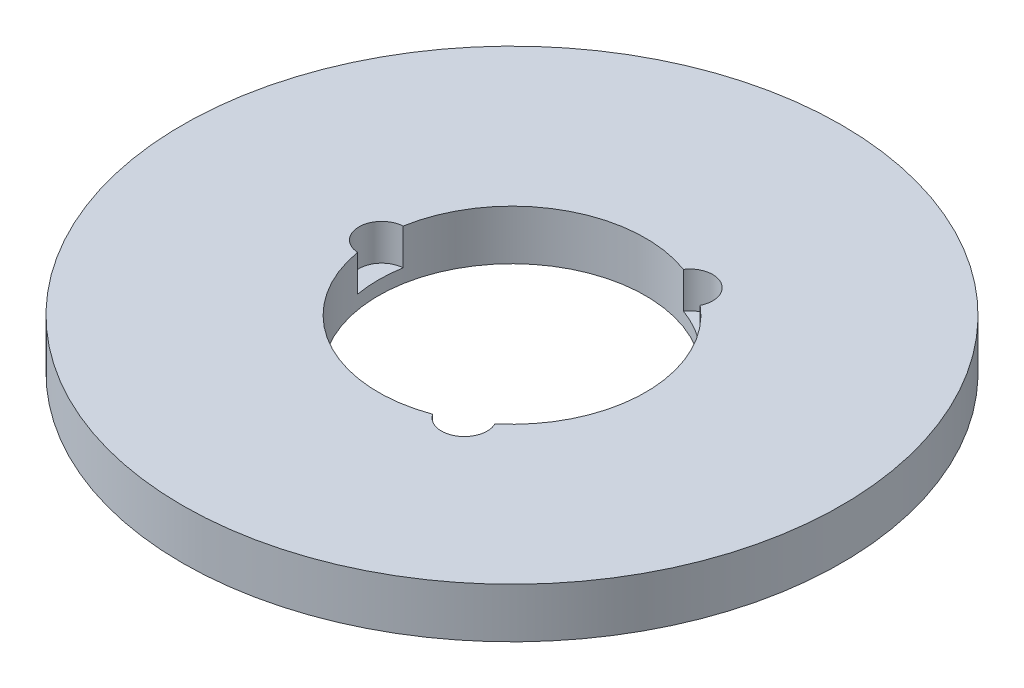
ISO-10303-21;
HEADER;
FILE_DESCRIPTION(('STEP AP214'),'2;1');
FILE_NAME('part.step','',(''),(''),'','','');
FILE_SCHEMA(('AUTOMOTIVE_DESIGN { 1 0 10303 214 1 1 1 1 }'));
ENDSEC;
DATA;
#1=APPLICATION_CONTEXT('core data for automotive mechanical design processes');
#2=APPLICATION_PROTOCOL_DEFINITION('international standard','automotive_design',2000,#1);
#3=PRODUCT_CONTEXT('',#1,'mechanical');
#4=PRODUCT('Part','Part','',(#3));
#5=PRODUCT_RELATED_PRODUCT_CATEGORY('part','',(#4));
#6=PRODUCT_DEFINITION_FORMATION('','',#4);
#7=PRODUCT_DEFINITION_CONTEXT('part definition',#1,'design');
#8=PRODUCT_DEFINITION('design','',#6,#7);
#9=PRODUCT_DEFINITION_SHAPE('','',#8);
#10=(LENGTH_UNIT() NAMED_UNIT(*) SI_UNIT(.MILLI.,.METRE.));
#11=(NAMED_UNIT(*) PLANE_ANGLE_UNIT() SI_UNIT($,.RADIAN.));
#12=(NAMED_UNIT(*) SI_UNIT($,.STERADIAN.) SOLID_ANGLE_UNIT());
#13=UNCERTAINTY_MEASURE_WITH_UNIT(LENGTH_MEASURE(1.E-05),#10,'distance_accuracy_value','');
#14=(GEOMETRIC_REPRESENTATION_CONTEXT(3) GLOBAL_UNCERTAINTY_ASSIGNED_CONTEXT((#13)) GLOBAL_UNIT_ASSIGNED_CONTEXT((#10,
#11,#12)) REPRESENTATION_CONTEXT('',''));
#15=CARTESIAN_POINT('',(0.,0.,0.));
#16=DIRECTION('',(0.,0.,1.));
#17=DIRECTION('',(1.,0.,0.));
#18=AXIS2_PLACEMENT_3D('',#15,#16,#17);
#19=CARTESIAN_POINT('',(0.,14.,0.));
#20=DIRECTION('',(0.,-1.,0.));
#21=DIRECTION('',(0.,0.,-1.));
#22=AXIS2_PLACEMENT_3D('',#19,#20,#21);
#23=CYLINDRICAL_SURFACE('',#22,92.5);
#24=CARTESIAN_POINT('',(0.,14.,0.));
#25=DIRECTION('',(0.,1.,0.));
#26=DIRECTION('',(0.,0.,1.));
#27=AXIS2_PLACEMENT_3D('',#24,#25,#26);
#28=CIRCLE('',#27,92.5);
#29=CARTESIAN_POINT('',(0.,14.,92.5));
#30=VERTEX_POINT('',#29);
#31=EDGE_CURVE('E130',#30,#30,#28,.T.);
#32=ORIENTED_EDGE('',*,*,#31,.F.);
#33=EDGE_LOOP('',(#32));
#34=FACE_BOUND('',#33,.T.);
#35=CARTESIAN_POINT('',(0.,0.,0.));
#36=DIRECTION('',(0.,1.,0.));
#37=DIRECTION('',(0.,0.,1.));
#38=AXIS2_PLACEMENT_3D('',#35,#36,#37);
#39=CIRCLE('',#38,92.5);
#40=CARTESIAN_POINT('',(0.,0.,92.5));
#41=VERTEX_POINT('',#40);
#42=EDGE_CURVE('E117',#41,#41,#39,.T.);
#43=ORIENTED_EDGE('',*,*,#42,.T.);
#44=EDGE_LOOP('',(#43));
#45=FACE_BOUND('',#44,.T.);
#46=ADVANCED_FACE('F39',(#34,#45),#23,.T.);
#47=CARTESIAN_POINT('',(0.,14.,0.));
#48=DIRECTION('',(0.,1.,0.));
#49=DIRECTION('',(0.,0.,1.));
#50=AXIS2_PLACEMENT_3D('',#47,#48,#49);
#51=PLANE('',#50);
#52=CARTESIAN_POINT('',(18.2737205284709,14.,31.6510123986256));
#53=DIRECTION('',(0.,1.,0.));
#54=DIRECTION('',(0.866025403784436,0.,-0.500000000000004));
#55=AXIS2_PLACEMENT_3D('',#52,#53,#54);
#56=CIRCLE('',#55,6.41534447104793);
#57=CARTESIAN_POINT('',(12.929740371945,14.,35.2004518992881));
#58=VERTEX_POINT('',#57);
#59=CARTESIAN_POINT('',(24.0196153835034,14.,28.7977095760855));
#60=VERTEX_POINT('',#59);
#61=EDGE_CURVE('E148',#58,#60,#56,.T.);
#62=ORIENTED_EDGE('',*,*,#61,.F.);
#63=CARTESIAN_POINT('',(0.,14.,0.));
#64=DIRECTION('',(0.,1.,0.));
#65=DIRECTION('',(0.,0.,1.));
#66=AXIS2_PLACEMENT_3D('',#63,#64,#65);
#67=CIRCLE('',#66,37.5);
#68=CARTESIAN_POINT('',(-36.9493557554482,14.,6.40274232320257));
#69=VERTEX_POINT('',#68);
#70=EDGE_CURVE('E113',#69,#58,#67,.T.);
#71=ORIENTED_EDGE('',*,*,#70,.F.);
#72=CARTESIAN_POINT('',(-36.5474410569414,14.,0.));
#73=DIRECTION('',(0.,1.,0.));
#74=DIRECTION('',(0.,0.,1.));
#75=AXIS2_PLACEMENT_3D('',#72,#73,#74);
#76=CIRCLE('',#75,6.41534447104793);
#77=CARTESIAN_POINT('',(-36.9493557554482,14.,-6.40274232320257));
#78=VERTEX_POINT('',#77);
#79=EDGE_CURVE('E125',#78,#69,#76,.T.);
#80=ORIENTED_EDGE('',*,*,#79,.F.);
#81=CARTESIAN_POINT('',(12.9297403719445,14.,-35.2004518992883));
#82=VERTEX_POINT('',#81);
#83=EDGE_CURVE('E107',#82,#78,#67,.T.);
#84=ORIENTED_EDGE('',*,*,#83,.F.);
#85=CARTESIAN_POINT('',(18.2737205284704,14.,-31.6510123986258));
#86=DIRECTION('',(0.,1.,0.));
#87=DIRECTION('',(-0.866025403784443,0.,-0.499999999999992));
#88=AXIS2_PLACEMENT_3D('',#85,#86,#87);
#89=CIRCLE('',#88,6.41534447104793);
#90=CARTESIAN_POINT('',(24.019615383503,14.,-28.7977095760858));
#91=VERTEX_POINT('',#90);
#92=EDGE_CURVE('E95',#91,#82,#89,.T.);
#93=ORIENTED_EDGE('',*,*,#92,.F.);
#94=EDGE_CURVE('E106',#60,#91,#67,.T.);
#95=ORIENTED_EDGE('',*,*,#94,.F.);
#96=EDGE_LOOP('',(#62,#71,#80,#84,#93,#95));
#97=FACE_BOUND('',#96,.T.);
#98=ORIENTED_EDGE('',*,*,#31,.T.);
#99=EDGE_LOOP('',(#98));
#100=FACE_BOUND('',#99,.T.);
#101=ADVANCED_FACE('F102',(#97,#100),#51,.T.);
#102=CARTESIAN_POINT('',(0.,0.,0.));
#103=DIRECTION('',(0.,1.,0.));
#104=DIRECTION('',(0.,0.,1.));
#105=AXIS2_PLACEMENT_3D('',#102,#103,#104);
#106=PLANE('',#105);
#107=CARTESIAN_POINT('',(0.,0.,0.));
#108=DIRECTION('',(0.,1.,0.));
#109=DIRECTION('',(0.,0.,1.));
#110=AXIS2_PLACEMENT_3D('',#107,#108,#109);
#111=CIRCLE('',#110,37.5);
#112=CARTESIAN_POINT('',(0.,0.,37.5));
#113=VERTEX_POINT('',#112);
#114=EDGE_CURVE('E118',#113,#113,#111,.T.);
#115=ORIENTED_EDGE('',*,*,#114,.T.);
#116=EDGE_LOOP('',(#115));
#117=FACE_BOUND('',#116,.T.);
#118=ORIENTED_EDGE('',*,*,#42,.F.);
#119=EDGE_LOOP('',(#118));
#120=FACE_BOUND('',#119,.T.);
#121=ADVANCED_FACE('F161',(#117,#120),#106,.F.);
#122=CARTESIAN_POINT('',(0.,14.,0.));
#123=DIRECTION('',(0.,-1.,0.));
#124=DIRECTION('',(0.,0.,-1.));
#125=AXIS2_PLACEMENT_3D('',#122,#123,#124);
#126=CYLINDRICAL_SURFACE('',#125,37.5);
#127=DIRECTION('',(0.,1.,0.));
#128=VECTOR('',#127,1.);
#129=CARTESIAN_POINT('',(12.929740371945,8.9209027273148,35.2004518992881));
#130=LINE('',#129,#128);
#131=CARTESIAN_POINT('',(12.929740371945,3.84180545462959,35.2004518992881));
#132=VERTEX_POINT('',#131);
#133=EDGE_CURVE('E11',#132,#58,#130,.T.);
#134=ORIENTED_EDGE('',*,*,#133,.F.);
#135=CARTESIAN_POINT('',(0.,3.84180545462959,0.));
#136=DIRECTION('',(0.,1.,0.));
#137=DIRECTION('',(0.,0.,1.));
#138=AXIS2_PLACEMENT_3D('',#135,#136,#137);
#139=CIRCLE('',#138,37.5);
#140=CARTESIAN_POINT('',(24.0196153835034,3.84180545462959,28.7977095760855));
#141=VERTEX_POINT('',#140);
#142=EDGE_CURVE('E100',#132,#141,#139,.T.);
#143=ORIENTED_EDGE('',*,*,#142,.T.);
#144=DIRECTION('',(0.,1.,0.));
#145=VECTOR('',#144,1.);
#146=CARTESIAN_POINT('',(24.0196153835034,8.9209027273148,28.7977095760855));
#147=LINE('',#146,#145);
#148=EDGE_CURVE('E46',#60,#141,#147,.F.);
#149=ORIENTED_EDGE('',*,*,#148,.F.);
#150=ORIENTED_EDGE('',*,*,#94,.T.);
#151=DIRECTION('',(0.,1.,0.));
#152=VECTOR('',#151,1.);
#153=CARTESIAN_POINT('',(24.019615383503,8.9209027273148,-28.7977095760858));
#154=LINE('',#153,#152);
#155=CARTESIAN_POINT('',(24.019615383503,3.84180545462959,-28.7977095760858));
#156=VERTEX_POINT('',#155);
#157=EDGE_CURVE('E90',#156,#91,#154,.T.);
#158=ORIENTED_EDGE('',*,*,#157,.F.);
#159=CARTESIAN_POINT('',(0.,3.84180545462959,0.));
#160=DIRECTION('',(0.,1.,0.));
#161=DIRECTION('',(0.,0.,1.));
#162=AXIS2_PLACEMENT_3D('',#159,#160,#161);
#163=CIRCLE('',#162,37.5);
#164=CARTESIAN_POINT('',(12.9297403719445,3.84180545462959,-35.2004518992883));
#165=VERTEX_POINT('',#164);
#166=EDGE_CURVE('E143',#156,#165,#163,.T.);
#167=ORIENTED_EDGE('',*,*,#166,.T.);
#168=DIRECTION('',(0.,1.,0.));
#169=VECTOR('',#168,1.);
#170=CARTESIAN_POINT('',(12.9297403719445,8.9209027273148,-35.2004518992883));
#171=LINE('',#170,#169);
#172=EDGE_CURVE('E98',#82,#165,#171,.F.);
#173=ORIENTED_EDGE('',*,*,#172,.F.);
#174=ORIENTED_EDGE('',*,*,#83,.T.);
#175=DIRECTION('',(0.,1.,0.));
#176=VECTOR('',#175,1.);
#177=CARTESIAN_POINT('',(-36.9493557554482,8.9209027273148,-6.40274232320257));
#178=LINE('',#177,#176);
#179=CARTESIAN_POINT('',(-36.9493557554482,3.84180545462959,-6.40274232320257));
#180=VERTEX_POINT('',#179);
#181=EDGE_CURVE('E137',#180,#78,#178,.T.);
#182=ORIENTED_EDGE('',*,*,#181,.F.);
#183=CARTESIAN_POINT('',(0.,3.84180545462959,0.));
#184=DIRECTION('',(0.,1.,0.));
#185=DIRECTION('',(0.,0.,1.));
#186=AXIS2_PLACEMENT_3D('',#183,#184,#185);
#187=CIRCLE('',#186,37.5);
#188=CARTESIAN_POINT('',(-36.9493557554482,3.84180545462959,6.40274232320257));
#189=VERTEX_POINT('',#188);
#190=EDGE_CURVE('E128',#180,#189,#187,.T.);
#191=ORIENTED_EDGE('',*,*,#190,.T.);
#192=DIRECTION('',(0.,1.,0.));
#193=VECTOR('',#192,1.);
#194=CARTESIAN_POINT('',(-36.9493557554482,8.9209027273148,6.40274232320257));
#195=LINE('',#194,#193);
#196=EDGE_CURVE('E134',#69,#189,#195,.F.);
#197=ORIENTED_EDGE('',*,*,#196,.F.);
#198=ORIENTED_EDGE('',*,*,#70,.T.);
#199=EDGE_LOOP('',(#134,#143,#149,#150,#158,#167,#173,#174,#182,#191,#197,#198));
#200=FACE_BOUND('',#199,.T.);
#201=ORIENTED_EDGE('',*,*,#114,.F.);
#202=EDGE_LOOP('',(#201));
#203=FACE_BOUND('',#202,.T.);
#204=ADVANCED_FACE('F115',(#200,#203),#126,.F.);
#205=CARTESIAN_POINT('',(-36.5474410569414,3.84180545462959,0.));
#206=DIRECTION('',(0.,1.,0.));
#207=DIRECTION('',(0.,0.,1.));
#208=AXIS2_PLACEMENT_3D('',#205,#206,#207);
#209=CYLINDRICAL_SURFACE('',#208,6.41534447104793);
#210=ORIENTED_EDGE('',*,*,#181,.T.);
#211=ORIENTED_EDGE('',*,*,#79,.T.);
#212=ORIENTED_EDGE('',*,*,#196,.T.);
#213=CARTESIAN_POINT('',(-36.5474410569414,3.84180545462959,0.));
#214=DIRECTION('',(0.,1.,0.));
#215=DIRECTION('',(0.,0.,1.));
#216=AXIS2_PLACEMENT_3D('',#213,#214,#215);
#217=CIRCLE('',#216,6.41534447104793);
#218=EDGE_CURVE('E127',#180,#189,#217,.T.);
#219=ORIENTED_EDGE('',*,*,#218,.F.);
#220=EDGE_LOOP('',(#210,#211,#212,#219));
#221=FACE_BOUND('',#220,.T.);
#222=ADVANCED_FACE('F175',(#221),#209,.F.);
#223=CARTESIAN_POINT('',(-36.5474410569414,3.84180545462959,0.));
#224=DIRECTION('',(0.,1.,0.));
#225=DIRECTION('',(0.,0.,1.));
#226=AXIS2_PLACEMENT_3D('',#223,#224,#225);
#227=PLANE('',#226);
#228=ORIENTED_EDGE('',*,*,#218,.T.);
#229=ORIENTED_EDGE('',*,*,#190,.F.);
#230=EDGE_LOOP('',(#228,#229));
#231=FACE_BOUND('',#230,.T.);
#232=ADVANCED_FACE('F176',(#231),#227,.T.);
#233=CARTESIAN_POINT('',(18.2737205284704,3.84180545462959,-31.6510123986258));
#234=DIRECTION('',(0.,1.,0.));
#235=DIRECTION('',(0.,0.,1.));
#236=AXIS2_PLACEMENT_3D('',#233,#234,#235);
#237=CYLINDRICAL_SURFACE('',#236,6.41534447104793);
#238=ORIENTED_EDGE('',*,*,#157,.T.);
#239=ORIENTED_EDGE('',*,*,#92,.T.);
#240=ORIENTED_EDGE('',*,*,#172,.T.);
#241=CARTESIAN_POINT('',(18.2737205284704,3.84180545462959,-31.6510123986258));
#242=DIRECTION('',(0.,1.,0.));
#243=DIRECTION('',(-0.866025403784443,0.,-0.499999999999992));
#244=AXIS2_PLACEMENT_3D('',#241,#242,#243);
#245=CIRCLE('',#244,6.41534447104793);
#246=EDGE_CURVE('E56',#156,#165,#245,.T.);
#247=ORIENTED_EDGE('',*,*,#246,.F.);
#248=EDGE_LOOP('',(#238,#239,#240,#247));
#249=FACE_BOUND('',#248,.T.);
#250=ADVANCED_FACE('F93',(#249),#237,.F.);
#251=CARTESIAN_POINT('',(18.2737205284704,3.84180545462959,-31.6510123986258));
#252=DIRECTION('',(0.,1.,0.));
#253=DIRECTION('',(-0.866025403784443,0.,-0.499999999999992));
#254=AXIS2_PLACEMENT_3D('',#251,#252,#253);
#255=PLANE('',#254);
#256=ORIENTED_EDGE('',*,*,#246,.T.);
#257=ORIENTED_EDGE('',*,*,#166,.F.);
#258=EDGE_LOOP('',(#256,#257));
#259=FACE_BOUND('',#258,.T.);
#260=ADVANCED_FACE('F153',(#259),#255,.T.);
#261=CARTESIAN_POINT('',(18.2737205284709,3.84180545462959,31.6510123986256));
#262=DIRECTION('',(0.,1.,0.));
#263=DIRECTION('',(0.,0.,1.));
#264=AXIS2_PLACEMENT_3D('',#261,#262,#263);
#265=CYLINDRICAL_SURFACE('',#264,6.41534447104793);
#266=ORIENTED_EDGE('',*,*,#133,.T.);
#267=ORIENTED_EDGE('',*,*,#61,.T.);
#268=ORIENTED_EDGE('',*,*,#148,.T.);
#269=CARTESIAN_POINT('',(18.2737205284709,3.84180545462959,31.6510123986256));
#270=DIRECTION('',(0.,1.,0.));
#271=DIRECTION('',(0.866025403784436,0.,-0.500000000000004));
#272=AXIS2_PLACEMENT_3D('',#269,#270,#271);
#273=CIRCLE('',#272,6.41534447104793);
#274=EDGE_CURVE('E55',#132,#141,#273,.T.);
#275=ORIENTED_EDGE('',*,*,#274,.F.);
#276=EDGE_LOOP('',(#266,#267,#268,#275));
#277=FACE_BOUND('',#276,.T.);
#278=ADVANCED_FACE('F144',(#277),#265,.F.);
#279=CARTESIAN_POINT('',(18.2737205284709,3.84180545462959,31.6510123986256));
#280=DIRECTION('',(0.,1.,0.));
#281=DIRECTION('',(0.866025403784436,0.,-0.500000000000004));
#282=AXIS2_PLACEMENT_3D('',#279,#280,#281);
#283=PLANE('',#282);
#284=ORIENTED_EDGE('',*,*,#274,.T.);
#285=ORIENTED_EDGE('',*,*,#142,.F.);
#286=EDGE_LOOP('',(#284,#285));
#287=FACE_BOUND('',#286,.T.);
#288=ADVANCED_FACE('F150',(#287),#283,.T.);
#289=CLOSED_SHELL('',(#46,#101,#121,#204,#222,#232,#250,#260,#278,#288));
#290=MANIFOLD_SOLID_BREP('B2',#289);
#291=ADVANCED_BREP_SHAPE_REPRESENTATION('',(#18,#290),#14);
#292=SHAPE_DEFINITION_REPRESENTATION(#9,#291);
ENDSEC;
END-ISO-10303-21;
